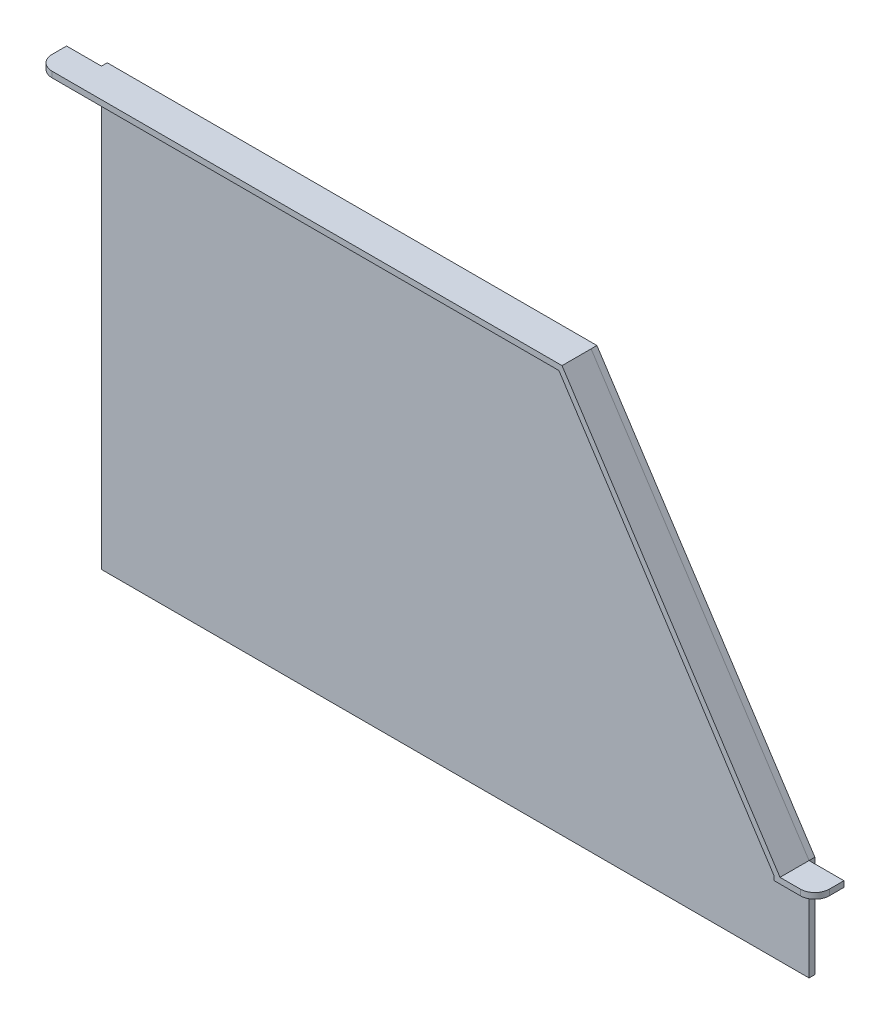
ISO-10303-21;
HEADER;
FILE_DESCRIPTION(('STEP AP214'),'2;1');
FILE_NAME('part.step','',(''),(''),'','','');
FILE_SCHEMA(('AUTOMOTIVE_DESIGN { 1 0 10303 214 1 1 1 1 }'));
ENDSEC;
DATA;
#1=APPLICATION_CONTEXT('core data for automotive mechanical design processes');
#2=APPLICATION_PROTOCOL_DEFINITION('international standard','automotive_design',2000,#1);
#3=PRODUCT_CONTEXT('',#1,'mechanical');
#4=PRODUCT('Part','Part','',(#3));
#5=PRODUCT_RELATED_PRODUCT_CATEGORY('part','',(#4));
#6=PRODUCT_DEFINITION_FORMATION('','',#4);
#7=PRODUCT_DEFINITION_CONTEXT('part definition',#1,'design');
#8=PRODUCT_DEFINITION('design','',#6,#7);
#9=PRODUCT_DEFINITION_SHAPE('','',#8);
#10=(LENGTH_UNIT() NAMED_UNIT(*) SI_UNIT(.MILLI.,.METRE.));
#11=(NAMED_UNIT(*) PLANE_ANGLE_UNIT() SI_UNIT($,.RADIAN.));
#12=(NAMED_UNIT(*) SI_UNIT($,.STERADIAN.) SOLID_ANGLE_UNIT());
#13=UNCERTAINTY_MEASURE_WITH_UNIT(LENGTH_MEASURE(1.E-05),#10,'distance_accuracy_value','');
#14=(GEOMETRIC_REPRESENTATION_CONTEXT(3) GLOBAL_UNCERTAINTY_ASSIGNED_CONTEXT((#13)) GLOBAL_UNIT_ASSIGNED_CONTEXT((#10,
#11,#12)) REPRESENTATION_CONTEXT('',''));
#15=CARTESIAN_POINT('',(0.,0.,0.));
#16=DIRECTION('',(0.,0.,1.));
#17=DIRECTION('',(1.,0.,0.));
#18=AXIS2_PLACEMENT_3D('',#15,#16,#17);
#19=CARTESIAN_POINT('',(0.,0.,4.));
#20=DIRECTION('',(1.,0.,0.));
#21=DIRECTION('',(0.,0.,-1.));
#22=AXIS2_PLACEMENT_3D('',#19,#20,#21);
#23=PLANE('',#22);
#24=DIRECTION('',(0.,-1.,0.));
#25=VECTOR('',#24,1.);
#26=CARTESIAN_POINT('',(0.,300.,4.));
#27=LINE('',#26,#25);
#28=CARTESIAN_POINT('',(0.,300.,4.));
#29=VERTEX_POINT('',#28);
#30=CARTESIAN_POINT('',(0.,296.,4.));
#31=VERTEX_POINT('',#30);
#32=EDGE_CURVE('E157',#29,#31,#27,.T.);
#33=ORIENTED_EDGE('',*,*,#32,.F.);
#34=DIRECTION('',(0.,0.,-1.));
#35=VECTOR('',#34,1.);
#36=CARTESIAN_POINT('',(0.,300.,4.));
#37=LINE('',#36,#35);
#38=CARTESIAN_POINT('',(0.,300.,0.));
#39=VERTEX_POINT('',#38);
#40=EDGE_CURVE('E164',#29,#39,#37,.T.);
#41=ORIENTED_EDGE('',*,*,#40,.T.);
#42=DIRECTION('',(0.,-1.,0.));
#43=VECTOR('',#42,1.);
#44=CARTESIAN_POINT('',(0.,0.,0.));
#45=LINE('',#44,#43);
#46=CARTESIAN_POINT('',(0.,0.,0.));
#47=VERTEX_POINT('',#46);
#48=EDGE_CURVE('E240',#39,#47,#45,.T.);
#49=ORIENTED_EDGE('',*,*,#48,.T.);
#50=DIRECTION('',(0.,0.,-1.));
#51=VECTOR('',#50,1.);
#52=CARTESIAN_POINT('',(0.,0.,4.));
#53=LINE('',#52,#51);
#54=CARTESIAN_POINT('',(0.,0.,4.));
#55=VERTEX_POINT('',#54);
#56=EDGE_CURVE('E250',#55,#47,#53,.T.);
#57=ORIENTED_EDGE('',*,*,#56,.F.);
#58=DIRECTION('',(0.,-1.,0.));
#59=VECTOR('',#58,1.);
#60=CARTESIAN_POINT('',(0.,0.,4.));
#61=LINE('',#60,#59);
#62=EDGE_CURVE('E248',#31,#55,#61,.T.);
#63=ORIENTED_EDGE('',*,*,#62,.F.);
#64=EDGE_LOOP('',(#33,#41,#49,#57,#63));
#65=FACE_BOUND('',#64,.T.);
#66=ADVANCED_FACE('F34',(#65),#23,.F.);
#67=CARTESIAN_POINT('',(487.,70.,4.));
#68=DIRECTION('',(-1.,0.,0.));
#69=DIRECTION('',(0.,0.,1.));
#70=AXIS2_PLACEMENT_3D('',#67,#68,#69);
#71=PLANE('',#70);
#72=DIRECTION('',(0.,1.,0.));
#73=VECTOR('',#72,1.);
#74=CARTESIAN_POINT('',(487.,70.,4.));
#75=LINE('',#74,#73);
#76=CARTESIAN_POINT('',(487.,66.,4.));
#77=VERTEX_POINT('',#76);
#78=CARTESIAN_POINT('',(487.,70.,4.));
#79=VERTEX_POINT('',#78);
#80=EDGE_CURVE('E167',#77,#79,#75,.T.);
#81=ORIENTED_EDGE('',*,*,#80,.F.);
#82=DIRECTION('',(0.,1.,0.));
#83=VECTOR('',#82,1.);
#84=CARTESIAN_POINT('',(487.,70.,4.));
#85=LINE('',#84,#83);
#86=CARTESIAN_POINT('',(487.,0.,4.));
#87=VERTEX_POINT('',#86);
#88=EDGE_CURVE('E239',#87,#77,#85,.T.);
#89=ORIENTED_EDGE('',*,*,#88,.F.);
#90=DIRECTION('',(0.,0.,-1.));
#91=VECTOR('',#90,1.);
#92=CARTESIAN_POINT('',(487.,0.,4.));
#93=LINE('',#92,#91);
#94=CARTESIAN_POINT('',(487.,0.,0.));
#95=VERTEX_POINT('',#94);
#96=EDGE_CURVE('E269',#87,#95,#93,.T.);
#97=ORIENTED_EDGE('',*,*,#96,.T.);
#98=DIRECTION('',(0.,1.,0.));
#99=VECTOR('',#98,1.);
#100=CARTESIAN_POINT('',(487.,70.,0.));
#101=LINE('',#100,#99);
#102=CARTESIAN_POINT('',(487.,70.,0.));
#103=VERTEX_POINT('',#102);
#104=EDGE_CURVE('E253',#95,#103,#101,.T.);
#105=ORIENTED_EDGE('',*,*,#104,.T.);
#106=DIRECTION('',(0.,0.,-1.));
#107=VECTOR('',#106,1.);
#108=CARTESIAN_POINT('',(487.,70.,4.));
#109=LINE('',#108,#107);
#110=EDGE_CURVE('E266',#79,#103,#109,.T.);
#111=ORIENTED_EDGE('',*,*,#110,.F.);
#112=EDGE_LOOP('',(#81,#89,#97,#105,#111));
#113=FACE_BOUND('',#112,.T.);
#114=ADVANCED_FACE('F296',(#113),#71,.F.);
#115=CARTESIAN_POINT('',(0.,0.,4.));
#116=DIRECTION('',(0.,0.,-1.));
#117=DIRECTION('',(-1.,0.,0.));
#118=AXIS2_PLACEMENT_3D('',#115,#116,#117);
#119=PLANE('',#118);
#120=DIRECTION('',(0.,-1.,0.));
#121=VECTOR('',#120,1.);
#122=CARTESIAN_POINT('',(483.,70.,4.));
#123=LINE('',#122,#121);
#124=CARTESIAN_POINT('',(483.,68.8108904611716,4.));
#125=VERTEX_POINT('',#124);
#126=CARTESIAN_POINT('',(483.,66.,4.));
#127=VERTEX_POINT('',#126);
#128=EDGE_CURVE('E195',#125,#127,#123,.T.);
#129=ORIENTED_EDGE('',*,*,#128,.F.);
#130=DIRECTION('',(0.546278076221482,-0.83760388217806,0.));
#131=VECTOR('',#130,1.);
#132=CARTESIAN_POINT('',(483.649584471288,67.814887695114,4.));
#133=LINE('',#132,#131);
#134=CARTESIAN_POINT('',(334.829209083155,296.,4.));
#135=VERTEX_POINT('',#134);
#136=EDGE_CURVE('E208',#135,#125,#133,.T.);
#137=ORIENTED_EDGE('',*,*,#136,.F.);
#138=DIRECTION('',(1.,0.,0.));
#139=VECTOR('',#138,1.);
#140=CARTESIAN_POINT('',(0.,296.,4.));
#141=LINE('',#140,#139);
#142=EDGE_CURVE('E224',#31,#135,#141,.T.);
#143=ORIENTED_EDGE('',*,*,#142,.F.);
#144=ORIENTED_EDGE('',*,*,#62,.T.);
#145=DIRECTION('',(1.,0.,0.));
#146=VECTOR('',#145,1.);
#147=CARTESIAN_POINT('',(487.,0.,4.));
#148=LINE('',#147,#146);
#149=EDGE_CURVE('E236',#55,#87,#148,.T.);
#150=ORIENTED_EDGE('',*,*,#149,.T.);
#151=ORIENTED_EDGE('',*,*,#88,.T.);
#152=DIRECTION('',(1.,0.,0.));
#153=VECTOR('',#152,1.);
#154=CARTESIAN_POINT('',(487.,66.,4.));
#155=LINE('',#154,#153);
#156=EDGE_CURVE('E199',#127,#77,#155,.T.);
#157=ORIENTED_EDGE('',*,*,#156,.F.);
#158=EDGE_LOOP('',(#129,#137,#143,#144,#150,#151,#157));
#159=FACE_BOUND('',#158,.T.);
#160=ADVANCED_FACE('F302',(#159),#119,.F.);
#161=CARTESIAN_POINT('',(483.649584471288,67.814887695114,24.));
#162=DIRECTION('',(0.83760388217806,0.546278076221482,0.));
#163=DIRECTION('',(-0.546278076221482,0.83760388217806,0.));
#164=AXIS2_PLACEMENT_3D('',#161,#162,#163);
#165=PLANE('',#164);
#166=DIRECTION('',(0.,0.,-1.));
#167=VECTOR('',#166,1.);
#168=CARTESIAN_POINT('',(483.,68.8108904611716,24.));
#169=LINE('',#168,#167);
#170=CARTESIAN_POINT('',(483.,68.8108904611716,24.));
#171=VERTEX_POINT('',#170);
#172=EDGE_CURVE('E272',#171,#125,#169,.T.);
#173=ORIENTED_EDGE('',*,*,#172,.F.);
#174=DIRECTION('',(0.546278076221482,-0.83760388217806,0.));
#175=VECTOR('',#174,1.);
#176=CARTESIAN_POINT('',(483.649584471288,67.814887695114,24.));
#177=LINE('',#176,#175);
#178=CARTESIAN_POINT('',(334.829209083155,296.,24.));
#179=VERTEX_POINT('',#178);
#180=EDGE_CURVE('E209',#179,#171,#177,.T.);
#181=ORIENTED_EDGE('',*,*,#180,.F.);
#182=DIRECTION('',(0.,0.,-1.));
#183=VECTOR('',#182,1.);
#184=CARTESIAN_POINT('',(334.829209083155,296.,24.));
#185=LINE('',#184,#183);
#186=EDGE_CURVE('E222',#179,#135,#185,.T.);
#187=ORIENTED_EDGE('',*,*,#186,.T.);
#188=ORIENTED_EDGE('',*,*,#136,.T.);
#189=EDGE_LOOP('',(#173,#181,#187,#188));
#190=FACE_BOUND('',#189,.T.);
#191=ADVANCED_FACE('F369',(#190),#165,.F.);
#192=DIRECTION('',(-0.546278076221482,0.837603882178059,0.));
#193=VECTOR('',#192,1.);
#194=CARTESIAN_POINT('',(336.995970405219,300.,4.));
#195=LINE('',#194,#193);
#196=CARTESIAN_POINT('',(336.995970405219,300.,4.));
#197=VERTEX_POINT('',#196);
#198=EDGE_CURVE('E213',#79,#197,#195,.T.);
#199=ORIENTED_EDGE('',*,*,#198,.F.);
#200=DIRECTION('',(-0.546267780546922,0.837610596838614,0.));
#201=VECTOR('',#200,1.);
#202=CARTESIAN_POINT('',(337.,300.,4.));
#203=LINE('',#202,#201);
#204=CARTESIAN_POINT('',(337.,300.,4.));
#205=VERTEX_POINT('',#204);
#206=EDGE_CURVE('E243',#79,#205,#203,.T.);
#207=ORIENTED_EDGE('',*,*,#206,.T.);
#208=DIRECTION('',(-1.,0.,0.));
#209=VECTOR('',#208,1.);
#210=CARTESIAN_POINT('',(0.,300.,4.));
#211=LINE('',#210,#209);
#212=EDGE_CURVE('E245',#205,#197,#211,.T.);
#213=ORIENTED_EDGE('',*,*,#212,.T.);
#214=EDGE_LOOP('',(#199,#207,#213));
#215=FACE_BOUND('',#214,.T.);
#216=ADVANCED_FACE('F322',(#215),#119,.F.);
#217=CARTESIAN_POINT('',(0.,296.,24.));
#218=DIRECTION('',(0.,1.,0.));
#219=DIRECTION('',(0.,0.,1.));
#220=AXIS2_PLACEMENT_3D('',#217,#218,#219);
#221=PLANE('',#220);
#222=DIRECTION('',(1.,0.,0.));
#223=VECTOR('',#222,1.);
#224=CARTESIAN_POINT('',(0.,296.,24.));
#225=LINE('',#224,#223);
#226=CARTESIAN_POINT('',(-14.,296.,24.));
#227=VERTEX_POINT('',#226);
#228=EDGE_CURVE('E225',#227,#179,#225,.T.);
#229=ORIENTED_EDGE('',*,*,#228,.F.);
#230=CARTESIAN_POINT('',(-14.,296.,14.));
#231=DIRECTION('',(0.,1.,0.));
#232=DIRECTION('',(0.,0.,1.));
#233=AXIS2_PLACEMENT_3D('',#230,#231,#232);
#234=CIRCLE('',#233,10.);
#235=CARTESIAN_POINT('',(-24.,296.,14.));
#236=VERTEX_POINT('',#235);
#237=EDGE_CURVE('E11',#227,#236,#234,.F.);
#238=ORIENTED_EDGE('',*,*,#237,.T.);
#239=DIRECTION('',(0.,0.,1.));
#240=VECTOR('',#239,1.);
#241=CARTESIAN_POINT('',(-24.,296.,24.));
#242=LINE('',#241,#240);
#243=CARTESIAN_POINT('',(-24.,296.,4.));
#244=VERTEX_POINT('',#243);
#245=EDGE_CURVE('E172',#244,#236,#242,.T.);
#246=ORIENTED_EDGE('',*,*,#245,.F.);
#247=DIRECTION('',(1.,0.,0.));
#248=VECTOR('',#247,1.);
#249=CARTESIAN_POINT('',(-24.,296.,4.));
#250=LINE('',#249,#248);
#251=EDGE_CURVE('E168',#244,#31,#250,.T.);
#252=ORIENTED_EDGE('',*,*,#251,.T.);
#253=ORIENTED_EDGE('',*,*,#142,.T.);
#254=ORIENTED_EDGE('',*,*,#186,.F.);
#255=EDGE_LOOP('',(#229,#238,#246,#252,#253,#254));
#256=FACE_BOUND('',#255,.T.);
#257=ADVANCED_FACE('F317',(#256),#221,.F.);
#258=CARTESIAN_POINT('',(487.,0.,4.));
#259=DIRECTION('',(0.,1.,0.));
#260=DIRECTION('',(-1.,0.,0.));
#261=AXIS2_PLACEMENT_3D('',#258,#259,#260);
#262=PLANE('',#261);
#263=DIRECTION('',(1.,0.,0.));
#264=VECTOR('',#263,1.);
#265=CARTESIAN_POINT('',(487.,0.,0.));
#266=LINE('',#265,#264);
#267=EDGE_CURVE('E235',#47,#95,#266,.T.);
#268=ORIENTED_EDGE('',*,*,#267,.T.);
#269=ORIENTED_EDGE('',*,*,#96,.F.);
#270=ORIENTED_EDGE('',*,*,#149,.F.);
#271=ORIENTED_EDGE('',*,*,#56,.T.);
#272=EDGE_LOOP('',(#268,#269,#270,#271));
#273=FACE_BOUND('',#272,.T.);
#274=ADVANCED_FACE('F313',(#273),#262,.F.);
#275=CARTESIAN_POINT('',(337.,300.,4.));
#276=DIRECTION('',(-0.837610596838614,-0.546267780546922,0.));
#277=DIRECTION('',(0.546267780546922,-0.837610596838614,0.));
#278=AXIS2_PLACEMENT_3D('',#275,#276,#277);
#279=PLANE('',#278);
#280=DIRECTION('',(-0.546267780546922,0.837610596838614,0.));
#281=VECTOR('',#280,1.);
#282=CARTESIAN_POINT('',(337.,300.,0.));
#283=LINE('',#282,#281);
#284=CARTESIAN_POINT('',(337.,300.,0.));
#285=VERTEX_POINT('',#284);
#286=EDGE_CURVE('E255',#103,#285,#283,.T.);
#287=ORIENTED_EDGE('',*,*,#286,.T.);
#288=DIRECTION('',(0.,0.,-1.));
#289=VECTOR('',#288,1.);
#290=CARTESIAN_POINT('',(337.,300.,4.));
#291=LINE('',#290,#289);
#292=EDGE_CURVE('E263',#205,#285,#291,.T.);
#293=ORIENTED_EDGE('',*,*,#292,.F.);
#294=ORIENTED_EDGE('',*,*,#206,.F.);
#295=ORIENTED_EDGE('',*,*,#110,.T.);
#296=EDGE_LOOP('',(#287,#293,#294,#295));
#297=FACE_BOUND('',#296,.T.);
#298=ADVANCED_FACE('F311',(#297),#279,.F.);
#299=CARTESIAN_POINT('',(0.,300.,4.));
#300=DIRECTION('',(0.,-1.,0.));
#301=DIRECTION('',(0.,0.,-1.));
#302=AXIS2_PLACEMENT_3D('',#299,#300,#301);
#303=PLANE('',#302);
#304=DIRECTION('',(0.,0.,-1.));
#305=VECTOR('',#304,1.);
#306=CARTESIAN_POINT('',(-24.,300.,24.));
#307=LINE('',#306,#305);
#308=CARTESIAN_POINT('',(-24.,300.,14.));
#309=VERTEX_POINT('',#308);
#310=CARTESIAN_POINT('',(-24.,300.,4.));
#311=VERTEX_POINT('',#310);
#312=EDGE_CURVE('E149',#309,#311,#307,.T.);
#313=ORIENTED_EDGE('',*,*,#312,.F.);
#314=CARTESIAN_POINT('',(-14.,300.,14.));
#315=DIRECTION('',(0.,-1.,0.));
#316=DIRECTION('',(0.,0.,-1.));
#317=AXIS2_PLACEMENT_3D('',#314,#315,#316);
#318=CIRCLE('',#317,10.);
#319=CARTESIAN_POINT('',(-14.,300.,24.));
#320=VERTEX_POINT('',#319);
#321=EDGE_CURVE('E42',#309,#320,#318,.F.);
#322=ORIENTED_EDGE('',*,*,#321,.T.);
#323=DIRECTION('',(-1.,0.,0.));
#324=VECTOR('',#323,1.);
#325=CARTESIAN_POINT('',(0.,300.,24.));
#326=LINE('',#325,#324);
#327=CARTESIAN_POINT('',(336.995970405219,300.,24.));
#328=VERTEX_POINT('',#327);
#329=EDGE_CURVE('E227',#328,#320,#326,.T.);
#330=ORIENTED_EDGE('',*,*,#329,.F.);
#331=DIRECTION('',(0.,0.,-1.));
#332=VECTOR('',#331,1.);
#333=CARTESIAN_POINT('',(336.995970405219,300.,24.));
#334=LINE('',#333,#332);
#335=EDGE_CURVE('E230',#328,#197,#334,.T.);
#336=ORIENTED_EDGE('',*,*,#335,.T.);
#337=ORIENTED_EDGE('',*,*,#212,.F.);
#338=ORIENTED_EDGE('',*,*,#292,.T.);
#339=DIRECTION('',(-1.,0.,0.));
#340=VECTOR('',#339,1.);
#341=CARTESIAN_POINT('',(0.,300.,0.));
#342=LINE('',#341,#340);
#343=EDGE_CURVE('E257',#285,#39,#342,.T.);
#344=ORIENTED_EDGE('',*,*,#343,.T.);
#345=ORIENTED_EDGE('',*,*,#40,.F.);
#346=DIRECTION('',(1.,0.,0.));
#347=VECTOR('',#346,1.);
#348=CARTESIAN_POINT('',(-24.,300.,4.));
#349=LINE('',#348,#347);
#350=EDGE_CURVE('E161',#311,#29,#349,.T.);
#351=ORIENTED_EDGE('',*,*,#350,.F.);
#352=EDGE_LOOP('',(#313,#322,#330,#336,#337,#338,#344,#345,#351));
#353=FACE_BOUND('',#352,.T.);
#354=ADVANCED_FACE('F162',(#353),#303,.F.);
#355=CARTESIAN_POINT('',(0.,0.,0.));
#356=DIRECTION('',(0.,0.,-1.));
#357=DIRECTION('',(-1.,0.,0.));
#358=AXIS2_PLACEMENT_3D('',#355,#356,#357);
#359=PLANE('',#358);
#360=ORIENTED_EDGE('',*,*,#267,.F.);
#361=ORIENTED_EDGE('',*,*,#48,.F.);
#362=ORIENTED_EDGE('',*,*,#343,.F.);
#363=ORIENTED_EDGE('',*,*,#286,.F.);
#364=ORIENTED_EDGE('',*,*,#104,.F.);
#365=EDGE_LOOP('',(#360,#361,#362,#363,#364));
#366=FACE_BOUND('',#365,.T.);
#367=ADVANCED_FACE('F307',(#366),#359,.T.);
#368=CARTESIAN_POINT('',(0.,0.,24.));
#369=DIRECTION('',(0.,0.,1.));
#370=DIRECTION('',(1.,0.,0.));
#371=AXIS2_PLACEMENT_3D('',#368,#369,#370);
#372=PLANE('',#371);
#373=DIRECTION('',(1.,0.,0.));
#374=VECTOR('',#373,1.);
#375=CARTESIAN_POINT('',(487.,66.,24.));
#376=LINE('',#375,#374);
#377=CARTESIAN_POINT('',(483.,66.,24.));
#378=VERTEX_POINT('',#377);
#379=CARTESIAN_POINT('',(501.,66.,24.));
#380=VERTEX_POINT('',#379);
#381=EDGE_CURVE('E198',#378,#380,#376,.T.);
#382=ORIENTED_EDGE('',*,*,#381,.T.);
#383=DIRECTION('',(0.,-1.,0.));
#384=VECTOR('',#383,1.);
#385=CARTESIAN_POINT('',(501.,70.,24.));
#386=LINE('',#385,#384);
#387=CARTESIAN_POINT('',(501.,70.,24.));
#388=VERTEX_POINT('',#387);
#389=EDGE_CURVE('E281',#380,#388,#386,.F.);
#390=ORIENTED_EDGE('',*,*,#389,.T.);
#391=DIRECTION('',(-1.,0.,0.));
#392=VECTOR('',#391,1.);
#393=CARTESIAN_POINT('',(511.,70.,24.));
#394=LINE('',#393,#392);
#395=CARTESIAN_POINT('',(487.,70.,24.));
#396=VERTEX_POINT('',#395);
#397=EDGE_CURVE('E185',#388,#396,#394,.T.);
#398=ORIENTED_EDGE('',*,*,#397,.T.);
#399=DIRECTION('',(-0.546278076221482,0.837603882178059,0.));
#400=VECTOR('',#399,1.);
#401=CARTESIAN_POINT('',(336.995970405219,300.,24.));
#402=LINE('',#401,#400);
#403=EDGE_CURVE('E212',#396,#328,#402,.T.);
#404=ORIENTED_EDGE('',*,*,#403,.T.);
#405=ORIENTED_EDGE('',*,*,#329,.T.);
#406=DIRECTION('',(0.,1.,0.));
#407=VECTOR('',#406,1.);
#408=CARTESIAN_POINT('',(-14.,296.,24.));
#409=LINE('',#408,#407);
#410=EDGE_CURVE('E279',#320,#227,#409,.F.);
#411=ORIENTED_EDGE('',*,*,#410,.T.);
#412=ORIENTED_EDGE('',*,*,#228,.T.);
#413=ORIENTED_EDGE('',*,*,#180,.T.);
#414=DIRECTION('',(0.,-1.,0.));
#415=VECTOR('',#414,1.);
#416=CARTESIAN_POINT('',(483.,70.,24.));
#417=LINE('',#416,#415);
#418=EDGE_CURVE('E196',#171,#378,#417,.T.);
#419=ORIENTED_EDGE('',*,*,#418,.T.);
#420=EDGE_LOOP('',(#382,#390,#398,#404,#405,#411,#412,#413,#419));
#421=FACE_BOUND('',#420,.T.);
#422=ADVANCED_FACE('F287',(#421),#372,.T.);
#423=CARTESIAN_POINT('',(336.995970405219,300.,24.));
#424=DIRECTION('',(-0.83760388217806,-0.546278076221482,0.));
#425=DIRECTION('',(0.546278076221482,-0.83760388217806,0.));
#426=AXIS2_PLACEMENT_3D('',#423,#424,#425);
#427=PLANE('',#426);
#428=ORIENTED_EDGE('',*,*,#198,.T.);
#429=ORIENTED_EDGE('',*,*,#335,.F.);
#430=ORIENTED_EDGE('',*,*,#403,.F.);
#431=DIRECTION('',(0.,0.,-1.));
#432=VECTOR('',#431,1.);
#433=CARTESIAN_POINT('',(487.,70.,24.));
#434=LINE('',#433,#432);
#435=EDGE_CURVE('E216',#396,#79,#434,.T.);
#436=ORIENTED_EDGE('',*,*,#435,.T.);
#437=EDGE_LOOP('',(#428,#429,#430,#436));
#438=FACE_BOUND('',#437,.T.);
#439=ADVANCED_FACE('F344',(#438),#427,.F.);
#440=CARTESIAN_POINT('',(483.,70.,24.));
#441=DIRECTION('',(1.,0.,0.));
#442=DIRECTION('',(0.,0.,-1.));
#443=AXIS2_PLACEMENT_3D('',#440,#441,#442);
#444=PLANE('',#443);
#445=ORIENTED_EDGE('',*,*,#418,.F.);
#446=ORIENTED_EDGE('',*,*,#172,.T.);
#447=ORIENTED_EDGE('',*,*,#128,.T.);
#448=DIRECTION('',(0.,0.,-1.));
#449=VECTOR('',#448,1.);
#450=CARTESIAN_POINT('',(483.,66.,24.));
#451=LINE('',#450,#449);
#452=EDGE_CURVE('E202',#378,#127,#451,.T.);
#453=ORIENTED_EDGE('',*,*,#452,.F.);
#454=EDGE_LOOP('',(#445,#446,#447,#453));
#455=FACE_BOUND('',#454,.T.);
#456=ADVANCED_FACE('F367',(#455),#444,.F.);
#457=CARTESIAN_POINT('',(487.,66.,24.));
#458=DIRECTION('',(0.,1.,0.));
#459=DIRECTION('',(0.,0.,1.));
#460=AXIS2_PLACEMENT_3D('',#457,#458,#459);
#461=PLANE('',#460);
#462=DIRECTION('',(0.,0.,-1.));
#463=VECTOR('',#462,1.);
#464=CARTESIAN_POINT('',(511.,66.,4.));
#465=LINE('',#464,#463);
#466=CARTESIAN_POINT('',(511.,66.,14.));
#467=VERTEX_POINT('',#466);
#468=CARTESIAN_POINT('',(511.,66.,4.));
#469=VERTEX_POINT('',#468);
#470=EDGE_CURVE('E178',#467,#469,#465,.T.);
#471=ORIENTED_EDGE('',*,*,#470,.F.);
#472=CARTESIAN_POINT('',(501.,66.,14.));
#473=DIRECTION('',(0.,1.,0.));
#474=DIRECTION('',(0.,0.,1.));
#475=AXIS2_PLACEMENT_3D('',#472,#473,#474);
#476=CIRCLE('',#475,10.);
#477=EDGE_CURVE('E277',#467,#380,#476,.F.);
#478=ORIENTED_EDGE('',*,*,#477,.T.);
#479=ORIENTED_EDGE('',*,*,#381,.F.);
#480=ORIENTED_EDGE('',*,*,#452,.T.);
#481=ORIENTED_EDGE('',*,*,#156,.T.);
#482=DIRECTION('',(-1.,0.,0.));
#483=VECTOR('',#482,1.);
#484=CARTESIAN_POINT('',(511.,66.,4.));
#485=LINE('',#484,#483);
#486=EDGE_CURVE('E192',#469,#77,#485,.T.);
#487=ORIENTED_EDGE('',*,*,#486,.F.);
#488=EDGE_LOOP('',(#471,#478,#479,#480,#481,#487));
#489=FACE_BOUND('',#488,.T.);
#490=ADVANCED_FACE('F362',(#489),#461,.F.);
#491=CARTESIAN_POINT('',(511.,70.,4.));
#492=DIRECTION('',(0.,0.,1.));
#493=DIRECTION('',(1.,0.,0.));
#494=AXIS2_PLACEMENT_3D('',#491,#492,#493);
#495=PLANE('',#494);
#496=ORIENTED_EDGE('',*,*,#80,.T.);
#497=DIRECTION('',(-1.,0.,0.));
#498=VECTOR('',#497,1.);
#499=CARTESIAN_POINT('',(511.,70.,4.));
#500=LINE('',#499,#498);
#501=CARTESIAN_POINT('',(511.,70.,4.));
#502=VERTEX_POINT('',#501);
#503=EDGE_CURVE('E189',#502,#79,#500,.T.);
#504=ORIENTED_EDGE('',*,*,#503,.F.);
#505=DIRECTION('',(0.,1.,0.));
#506=VECTOR('',#505,1.);
#507=CARTESIAN_POINT('',(511.,70.,4.));
#508=LINE('',#507,#506);
#509=EDGE_CURVE('E180',#469,#502,#508,.T.);
#510=ORIENTED_EDGE('',*,*,#509,.F.);
#511=ORIENTED_EDGE('',*,*,#486,.T.);
#512=EDGE_LOOP('',(#496,#504,#510,#511));
#513=FACE_BOUND('',#512,.T.);
#514=ADVANCED_FACE('F349',(#513),#495,.F.);
#515=CARTESIAN_POINT('',(511.,70.,4.));
#516=DIRECTION('',(0.,-1.,0.));
#517=DIRECTION('',(0.,0.,-1.));
#518=AXIS2_PLACEMENT_3D('',#515,#516,#517);
#519=PLANE('',#518);
#520=ORIENTED_EDGE('',*,*,#397,.F.);
#521=CARTESIAN_POINT('',(501.,70.,14.));
#522=DIRECTION('',(0.,-1.,0.));
#523=DIRECTION('',(0.,0.,-1.));
#524=AXIS2_PLACEMENT_3D('',#521,#522,#523);
#525=CIRCLE('',#524,10.);
#526=CARTESIAN_POINT('',(511.,70.,14.));
#527=VERTEX_POINT('',#526);
#528=EDGE_CURVE('E283',#388,#527,#525,.F.);
#529=ORIENTED_EDGE('',*,*,#528,.T.);
#530=DIRECTION('',(0.,0.,1.));
#531=VECTOR('',#530,1.);
#532=CARTESIAN_POINT('',(511.,70.,4.));
#533=LINE('',#532,#531);
#534=EDGE_CURVE('E182',#502,#527,#533,.T.);
#535=ORIENTED_EDGE('',*,*,#534,.F.);
#536=ORIENTED_EDGE('',*,*,#503,.T.);
#537=ORIENTED_EDGE('',*,*,#435,.F.);
#538=EDGE_LOOP('',(#520,#529,#535,#536,#537));
#539=FACE_BOUND('',#538,.T.);
#540=ADVANCED_FACE('F353',(#539),#519,.F.);
#541=CARTESIAN_POINT('',(511.,0.,0.));
#542=DIRECTION('',(-1.,0.,0.));
#543=DIRECTION('',(0.,0.,1.));
#544=AXIS2_PLACEMENT_3D('',#541,#542,#543);
#545=PLANE('',#544);
#546=ORIENTED_EDGE('',*,*,#534,.T.);
#547=DIRECTION('',(0.,-1.,0.));
#548=VECTOR('',#547,1.);
#549=CARTESIAN_POINT('',(511.,66.,14.));
#550=LINE('',#549,#548);
#551=EDGE_CURVE('E274',#527,#467,#550,.T.);
#552=ORIENTED_EDGE('',*,*,#551,.T.);
#553=ORIENTED_EDGE('',*,*,#470,.T.);
#554=ORIENTED_EDGE('',*,*,#509,.T.);
#555=EDGE_LOOP('',(#546,#552,#553,#554));
#556=FACE_BOUND('',#555,.T.);
#557=ADVANCED_FACE('F357',(#556),#545,.F.);
#558=CARTESIAN_POINT('',(-24.,300.,4.));
#559=DIRECTION('',(0.,0.,1.));
#560=DIRECTION('',(1.,0.,0.));
#561=AXIS2_PLACEMENT_3D('',#558,#559,#560);
#562=PLANE('',#561);
#563=ORIENTED_EDGE('',*,*,#32,.T.);
#564=ORIENTED_EDGE('',*,*,#251,.F.);
#565=DIRECTION('',(0.,-1.,0.));
#566=VECTOR('',#565,1.);
#567=CARTESIAN_POINT('',(-24.,300.,4.));
#568=LINE('',#567,#566);
#569=EDGE_CURVE('E153',#311,#244,#568,.T.);
#570=ORIENTED_EDGE('',*,*,#569,.F.);
#571=ORIENTED_EDGE('',*,*,#350,.T.);
#572=EDGE_LOOP('',(#563,#564,#570,#571));
#573=FACE_BOUND('',#572,.T.);
#574=ADVANCED_FACE('F170',(#573),#562,.F.);
#575=CARTESIAN_POINT('',(-24.,0.,0.));
#576=DIRECTION('',(1.,0.,0.));
#577=DIRECTION('',(0.,0.,-1.));
#578=AXIS2_PLACEMENT_3D('',#575,#576,#577);
#579=PLANE('',#578);
#580=ORIENTED_EDGE('',*,*,#245,.T.);
#581=DIRECTION('',(0.,1.,0.));
#582=VECTOR('',#581,1.);
#583=CARTESIAN_POINT('',(-24.,300.,14.));
#584=LINE('',#583,#582);
#585=EDGE_CURVE('E155',#236,#309,#584,.T.);
#586=ORIENTED_EDGE('',*,*,#585,.T.);
#587=ORIENTED_EDGE('',*,*,#312,.T.);
#588=ORIENTED_EDGE('',*,*,#569,.T.);
#589=EDGE_LOOP('',(#580,#586,#587,#588));
#590=FACE_BOUND('',#589,.T.);
#591=ADVANCED_FACE('F151',(#590),#579,.F.);
#592=CARTESIAN_POINT('',(501.,0.,14.));
#593=DIRECTION('',(0.,1.,0.));
#594=DIRECTION('',(0.,0.,1.));
#595=AXIS2_PLACEMENT_3D('',#592,#593,#594);
#596=CYLINDRICAL_SURFACE('',#595,10.);
#597=ORIENTED_EDGE('',*,*,#528,.F.);
#598=ORIENTED_EDGE('',*,*,#389,.F.);
#599=ORIENTED_EDGE('',*,*,#477,.F.);
#600=ORIENTED_EDGE('',*,*,#551,.F.);
#601=EDGE_LOOP('',(#597,#598,#599,#600));
#602=FACE_BOUND('',#601,.T.);
#603=ADVANCED_FACE('F290',(#602),#596,.T.);
#604=CARTESIAN_POINT('',(-14.,0.,14.));
#605=DIRECTION('',(0.,-1.,0.));
#606=DIRECTION('',(0.,0.,-1.));
#607=AXIS2_PLACEMENT_3D('',#604,#605,#606);
#608=CYLINDRICAL_SURFACE('',#607,10.);
#609=ORIENTED_EDGE('',*,*,#237,.F.);
#610=ORIENTED_EDGE('',*,*,#410,.F.);
#611=ORIENTED_EDGE('',*,*,#321,.F.);
#612=ORIENTED_EDGE('',*,*,#585,.F.);
#613=EDGE_LOOP('',(#609,#610,#611,#612));
#614=FACE_BOUND('',#613,.T.);
#615=ADVANCED_FACE('F36',(#614),#608,.T.);
#616=CLOSED_SHELL('',(#66,#114,#160,#191,#216,#257,#274,#298,#354,#367,#422,#439,#456,#490,#514,
#540,#557,#574,#591,#603,#615));
#617=MANIFOLD_SOLID_BREP('B2',#616);
#618=ADVANCED_BREP_SHAPE_REPRESENTATION('',(#18,#617),#14);
#619=SHAPE_DEFINITION_REPRESENTATION(#9,#618);
ENDSEC;
END-ISO-10303-21;
